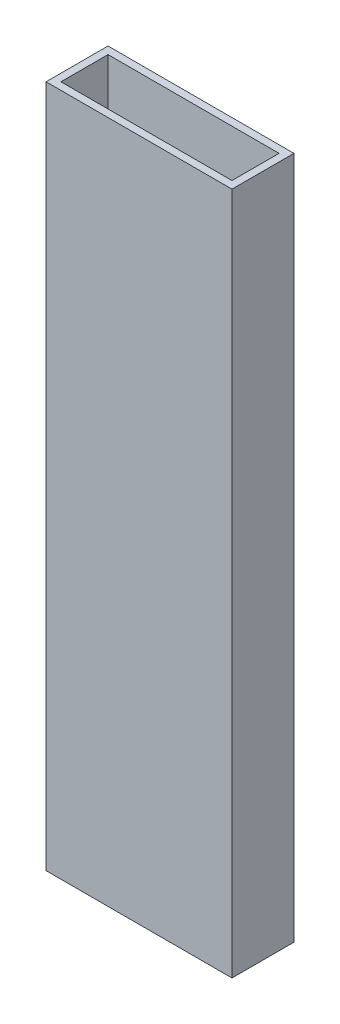
ISO-10303-21;
HEADER;
FILE_DESCRIPTION(('STEP AP214'),'2;1');
FILE_NAME('part.step','',(''),(''),'','','');
FILE_SCHEMA(('AUTOMOTIVE_DESIGN { 1 0 10303 214 1 1 1 1 }'));
ENDSEC;
DATA;
#1=APPLICATION_CONTEXT('core data for automotive mechanical design processes');
#2=APPLICATION_PROTOCOL_DEFINITION('international standard','automotive_design',2000,#1);
#3=PRODUCT_CONTEXT('',#1,'mechanical');
#4=PRODUCT('Part','Part','',(#3));
#5=PRODUCT_RELATED_PRODUCT_CATEGORY('part','',(#4));
#6=PRODUCT_DEFINITION_FORMATION('','',#4);
#7=PRODUCT_DEFINITION_CONTEXT('part definition',#1,'design');
#8=PRODUCT_DEFINITION('design','',#6,#7);
#9=PRODUCT_DEFINITION_SHAPE('','',#8);
#10=(LENGTH_UNIT() NAMED_UNIT(*) SI_UNIT(.MILLI.,.METRE.));
#11=(NAMED_UNIT(*) PLANE_ANGLE_UNIT() SI_UNIT($,.RADIAN.));
#12=(NAMED_UNIT(*) SI_UNIT($,.STERADIAN.) SOLID_ANGLE_UNIT());
#13=UNCERTAINTY_MEASURE_WITH_UNIT(LENGTH_MEASURE(1.E-05),#10,'distance_accuracy_value','');
#14=(GEOMETRIC_REPRESENTATION_CONTEXT(3) GLOBAL_UNCERTAINTY_ASSIGNED_CONTEXT((#13)) GLOBAL_UNIT_ASSIGNED_CONTEXT((#10,
#11,#12)) REPRESENTATION_CONTEXT('',''));
#15=CARTESIAN_POINT('',(0.,0.,0.));
#16=DIRECTION('',(0.,0.,1.));
#17=DIRECTION('',(1.,0.,0.));
#18=AXIS2_PLACEMENT_3D('',#15,#16,#17);
#19=CARTESIAN_POINT('',(-38.1,305.4,-12.7));
#20=DIRECTION('',(1.,0.,0.));
#21=DIRECTION('',(0.,0.,-1.));
#22=AXIS2_PLACEMENT_3D('',#19,#20,#21);
#23=PLANE('',#22);
#24=DIRECTION('',(0.,0.,1.));
#25=VECTOR('',#24,1.);
#26=CARTESIAN_POINT('',(-38.1,12.7,-38.1));
#27=LINE('',#26,#25);
#28=CARTESIAN_POINT('',(-38.1,12.7,-12.7));
#29=VERTEX_POINT('',#28);
#30=CARTESIAN_POINT('',(-38.1,12.7,12.7));
#31=VERTEX_POINT('',#30);
#32=EDGE_CURVE('E50',#29,#31,#27,.T.);
#33=ORIENTED_EDGE('',*,*,#32,.T.);
#34=DIRECTION('',(0.,-1.,0.));
#35=VECTOR('',#34,1.);
#36=CARTESIAN_POINT('',(-38.1,305.4,12.7));
#37=LINE('',#36,#35);
#38=CARTESIAN_POINT('',(-38.1,292.7,12.7));
#39=VERTEX_POINT('',#38);
#40=EDGE_CURVE('E112',#39,#31,#37,.T.);
#41=ORIENTED_EDGE('',*,*,#40,.F.);
#42=DIRECTION('',(0.,0.,1.));
#43=VECTOR('',#42,1.);
#44=CARTESIAN_POINT('',(-38.1,292.7,-38.1));
#45=LINE('',#44,#43);
#46=CARTESIAN_POINT('',(-38.1,292.7,-12.7));
#47=VERTEX_POINT('',#46);
#48=EDGE_CURVE('E105',#47,#39,#45,.T.);
#49=ORIENTED_EDGE('',*,*,#48,.F.);
#50=DIRECTION('',(0.,-1.,0.));
#51=VECTOR('',#50,1.);
#52=CARTESIAN_POINT('',(-38.1,305.4,-12.7));
#53=LINE('',#52,#51);
#54=EDGE_CURVE('E114',#47,#29,#53,.T.);
#55=ORIENTED_EDGE('',*,*,#54,.T.);
#56=EDGE_LOOP('',(#33,#41,#49,#55));
#57=FACE_BOUND('',#56,.T.);
#58=ADVANCED_FACE('F36',(#57),#23,.F.);
#59=CARTESIAN_POINT('',(-38.1,305.4,12.7));
#60=DIRECTION('',(0.,0.,-1.));
#61=DIRECTION('',(-1.,0.,0.));
#62=AXIS2_PLACEMENT_3D('',#59,#60,#61);
#63=PLANE('',#62);
#64=DIRECTION('',(-1.,0.,0.));
#65=VECTOR('',#64,1.);
#66=CARTESIAN_POINT('',(-38.1,12.7,12.7));
#67=LINE('',#66,#65);
#68=CARTESIAN_POINT('',(38.1,12.7,12.7));
#69=VERTEX_POINT('',#68);
#70=EDGE_CURVE('E97',#69,#31,#67,.T.);
#71=ORIENTED_EDGE('',*,*,#70,.F.);
#72=DIRECTION('',(0.,-1.,0.));
#73=VECTOR('',#72,1.);
#74=CARTESIAN_POINT('',(38.1,305.4,12.7));
#75=LINE('',#74,#73);
#76=CARTESIAN_POINT('',(38.1,292.7,12.7));
#77=VERTEX_POINT('',#76);
#78=EDGE_CURVE('E119',#77,#69,#75,.T.);
#79=ORIENTED_EDGE('',*,*,#78,.F.);
#80=DIRECTION('',(1.,0.,0.));
#81=VECTOR('',#80,1.);
#82=CARTESIAN_POINT('',(-38.1,292.7,12.7));
#83=LINE('',#82,#81);
#84=EDGE_CURVE('E118',#39,#77,#83,.T.);
#85=ORIENTED_EDGE('',*,*,#84,.F.);
#86=ORIENTED_EDGE('',*,*,#40,.T.);
#87=EDGE_LOOP('',(#71,#79,#85,#86));
#88=FACE_BOUND('',#87,.T.);
#89=ADVANCED_FACE('F117',(#88),#63,.F.);
#90=CARTESIAN_POINT('',(38.1,305.4,-12.7));
#91=DIRECTION('',(-1.,0.,0.));
#92=DIRECTION('',(0.,0.,1.));
#93=AXIS2_PLACEMENT_3D('',#90,#91,#92);
#94=PLANE('',#93);
#95=DIRECTION('',(0.,0.,1.));
#96=VECTOR('',#95,1.);
#97=CARTESIAN_POINT('',(38.1,12.7,-38.1));
#98=LINE('',#97,#96);
#99=CARTESIAN_POINT('',(38.1,12.7,-12.7));
#100=VERTEX_POINT('',#99);
#101=EDGE_CURVE('E100',#100,#69,#98,.T.);
#102=ORIENTED_EDGE('',*,*,#101,.F.);
#103=DIRECTION('',(0.,-1.,0.));
#104=VECTOR('',#103,1.);
#105=CARTESIAN_POINT('',(38.1,305.4,-12.7));
#106=LINE('',#105,#104);
#107=CARTESIAN_POINT('',(38.1,292.7,-12.7));
#108=VERTEX_POINT('',#107);
#109=EDGE_CURVE('E122',#108,#100,#106,.T.);
#110=ORIENTED_EDGE('',*,*,#109,.F.);
#111=DIRECTION('',(0.,0.,1.));
#112=VECTOR('',#111,1.);
#113=CARTESIAN_POINT('',(38.1,292.7,-38.1));
#114=LINE('',#113,#112);
#115=EDGE_CURVE('E152',#108,#77,#114,.T.);
#116=ORIENTED_EDGE('',*,*,#115,.T.);
#117=ORIENTED_EDGE('',*,*,#78,.T.);
#118=EDGE_LOOP('',(#102,#110,#116,#117));
#119=FACE_BOUND('',#118,.T.);
#120=ADVANCED_FACE('F189',(#119),#94,.F.);
#121=CARTESIAN_POINT('',(-38.1,305.4,-12.7));
#122=DIRECTION('',(0.,0.,1.));
#123=DIRECTION('',(1.,0.,0.));
#124=AXIS2_PLACEMENT_3D('',#121,#122,#123);
#125=PLANE('',#124);
#126=DIRECTION('',(1.,0.,0.));
#127=VECTOR('',#126,1.);
#128=CARTESIAN_POINT('',(-38.1,12.7,-12.7));
#129=LINE('',#128,#127);
#130=EDGE_CURVE('E106',#29,#100,#129,.T.);
#131=ORIENTED_EDGE('',*,*,#130,.F.);
#132=ORIENTED_EDGE('',*,*,#54,.F.);
#133=DIRECTION('',(-1.,0.,0.));
#134=VECTOR('',#133,1.);
#135=CARTESIAN_POINT('',(-38.1,292.7,-12.7));
#136=LINE('',#135,#134);
#137=EDGE_CURVE('E141',#108,#47,#136,.T.);
#138=ORIENTED_EDGE('',*,*,#137,.F.);
#139=ORIENTED_EDGE('',*,*,#109,.T.);
#140=EDGE_LOOP('',(#131,#132,#138,#139));
#141=FACE_BOUND('',#140,.T.);
#142=ADVANCED_FACE('F193',(#141),#125,.F.);
#143=CARTESIAN_POINT('',(-35.052,305.4,-9.65199999999999));
#144=DIRECTION('',(1.,0.,0.));
#145=DIRECTION('',(0.,0.,-1.));
#146=AXIS2_PLACEMENT_3D('',#143,#144,#145);
#147=PLANE('',#146);
#148=DIRECTION('',(0.,-1.,0.));
#149=VECTOR('',#148,1.);
#150=CARTESIAN_POINT('',(-35.052,305.4,9.652));
#151=LINE('',#150,#149);
#152=CARTESIAN_POINT('',(-35.052,292.7,9.652));
#153=VERTEX_POINT('',#152);
#154=CARTESIAN_POINT('',(-35.052,12.7,9.652));
#155=VERTEX_POINT('',#154);
#156=EDGE_CURVE('E128',#153,#155,#151,.T.);
#157=ORIENTED_EDGE('',*,*,#156,.T.);
#158=DIRECTION('',(0.,0.,-1.));
#159=VECTOR('',#158,1.);
#160=CARTESIAN_POINT('',(-35.052,12.7,-9.65199999999997));
#161=LINE('',#160,#159);
#162=CARTESIAN_POINT('',(-35.052,12.7,-9.65199999999999));
#163=VERTEX_POINT('',#162);
#164=EDGE_CURVE('E157',#155,#163,#161,.T.);
#165=ORIENTED_EDGE('',*,*,#164,.T.);
#166=DIRECTION('',(0.,-1.,0.));
#167=VECTOR('',#166,1.);
#168=CARTESIAN_POINT('',(-35.052,305.4,-9.65199999999999));
#169=LINE('',#168,#167);
#170=CARTESIAN_POINT('',(-35.052,292.7,-9.65199999999999));
#171=VERTEX_POINT('',#170);
#172=EDGE_CURVE('E137',#171,#163,#169,.T.);
#173=ORIENTED_EDGE('',*,*,#172,.F.);
#174=DIRECTION('',(0.,0.,1.));
#175=VECTOR('',#174,1.);
#176=CARTESIAN_POINT('',(-35.052,292.7,-9.65199999999999));
#177=LINE('',#176,#175);
#178=EDGE_CURVE('E143',#171,#153,#177,.T.);
#179=ORIENTED_EDGE('',*,*,#178,.T.);
#180=EDGE_LOOP('',(#157,#165,#173,#179));
#181=FACE_BOUND('',#180,.T.);
#182=ADVANCED_FACE('F176',(#181),#147,.T.);
#183=CARTESIAN_POINT('',(-35.052,305.4,9.652));
#184=DIRECTION('',(0.,0.,-1.));
#185=DIRECTION('',(-1.,0.,0.));
#186=AXIS2_PLACEMENT_3D('',#183,#184,#185);
#187=PLANE('',#186);
#188=DIRECTION('',(0.,-1.,0.));
#189=VECTOR('',#188,1.);
#190=CARTESIAN_POINT('',(35.052,305.4,9.65199999999999));
#191=LINE('',#190,#189);
#192=CARTESIAN_POINT('',(35.052,292.7,9.65199999999999));
#193=VERTEX_POINT('',#192);
#194=CARTESIAN_POINT('',(35.052,12.7,9.65199999999999));
#195=VERTEX_POINT('',#194);
#196=EDGE_CURVE('E131',#193,#195,#191,.T.);
#197=ORIENTED_EDGE('',*,*,#196,.T.);
#198=DIRECTION('',(-1.,0.,0.));
#199=VECTOR('',#198,1.);
#200=CARTESIAN_POINT('',(-35.052,12.7,9.652));
#201=LINE('',#200,#199);
#202=EDGE_CURVE('E160',#195,#155,#201,.T.);
#203=ORIENTED_EDGE('',*,*,#202,.T.);
#204=ORIENTED_EDGE('',*,*,#156,.F.);
#205=DIRECTION('',(1.,0.,0.));
#206=VECTOR('',#205,1.);
#207=CARTESIAN_POINT('',(-35.052,292.7,9.652));
#208=LINE('',#207,#206);
#209=EDGE_CURVE('E146',#153,#193,#208,.T.);
#210=ORIENTED_EDGE('',*,*,#209,.T.);
#211=EDGE_LOOP('',(#197,#203,#204,#210));
#212=FACE_BOUND('',#211,.T.);
#213=ADVANCED_FACE('F169',(#212),#187,.T.);
#214=CARTESIAN_POINT('',(35.052,305.4,-9.652));
#215=DIRECTION('',(-1.,0.,0.));
#216=DIRECTION('',(0.,0.,1.));
#217=AXIS2_PLACEMENT_3D('',#214,#215,#216);
#218=PLANE('',#217);
#219=DIRECTION('',(0.,-1.,0.));
#220=VECTOR('',#219,1.);
#221=CARTESIAN_POINT('',(35.052,305.4,-9.652));
#222=LINE('',#221,#220);
#223=CARTESIAN_POINT('',(35.052,292.7,-9.652));
#224=VERTEX_POINT('',#223);
#225=CARTESIAN_POINT('',(35.052,12.7,-9.652));
#226=VERTEX_POINT('',#225);
#227=EDGE_CURVE('E134',#224,#226,#222,.T.);
#228=ORIENTED_EDGE('',*,*,#227,.T.);
#229=DIRECTION('',(0.,0.,1.));
#230=VECTOR('',#229,1.);
#231=CARTESIAN_POINT('',(35.052,12.7,-9.65199999999998));
#232=LINE('',#231,#230);
#233=EDGE_CURVE('E58',#226,#195,#232,.T.);
#234=ORIENTED_EDGE('',*,*,#233,.T.);
#235=ORIENTED_EDGE('',*,*,#196,.F.);
#236=DIRECTION('',(0.,0.,-1.));
#237=VECTOR('',#236,1.);
#238=CARTESIAN_POINT('',(35.052,292.7,-9.652));
#239=LINE('',#238,#237);
#240=EDGE_CURVE('E149',#193,#224,#239,.T.);
#241=ORIENTED_EDGE('',*,*,#240,.T.);
#242=EDGE_LOOP('',(#228,#234,#235,#241));
#243=FACE_BOUND('',#242,.T.);
#244=ADVANCED_FACE('F166',(#243),#218,.T.);
#245=CARTESIAN_POINT('',(-35.052,305.4,-9.65199999999999));
#246=DIRECTION('',(0.,0.,1.));
#247=DIRECTION('',(1.,0.,0.));
#248=AXIS2_PLACEMENT_3D('',#245,#246,#247);
#249=PLANE('',#248);
#250=ORIENTED_EDGE('',*,*,#172,.T.);
#251=DIRECTION('',(1.,0.,0.));
#252=VECTOR('',#251,1.);
#253=CARTESIAN_POINT('',(-35.052,12.7,-9.65199999999999));
#254=LINE('',#253,#252);
#255=EDGE_CURVE('E11',#163,#226,#254,.T.);
#256=ORIENTED_EDGE('',*,*,#255,.T.);
#257=ORIENTED_EDGE('',*,*,#227,.F.);
#258=DIRECTION('',(-1.,0.,0.));
#259=VECTOR('',#258,1.);
#260=CARTESIAN_POINT('',(-35.052,292.7,-9.65199999999999));
#261=LINE('',#260,#259);
#262=EDGE_CURVE('E43',#224,#171,#261,.T.);
#263=ORIENTED_EDGE('',*,*,#262,.T.);
#264=EDGE_LOOP('',(#250,#256,#257,#263));
#265=FACE_BOUND('',#264,.T.);
#266=ADVANCED_FACE('F178',(#265),#249,.T.);
#267=CARTESIAN_POINT('',(-38.1,292.7,-38.1));
#268=DIRECTION('',(0.,1.,0.));
#269=DIRECTION('',(0.,0.,1.));
#270=AXIS2_PLACEMENT_3D('',#267,#268,#269);
#271=PLANE('',#270);
#272=ORIENTED_EDGE('',*,*,#262,.F.);
#273=ORIENTED_EDGE('',*,*,#240,.F.);
#274=ORIENTED_EDGE('',*,*,#209,.F.);
#275=ORIENTED_EDGE('',*,*,#178,.F.);
#276=EDGE_LOOP('',(#272,#273,#274,#275));
#277=FACE_BOUND('',#276,.T.);
#278=ORIENTED_EDGE('',*,*,#84,.T.);
#279=ORIENTED_EDGE('',*,*,#115,.F.);
#280=ORIENTED_EDGE('',*,*,#137,.T.);
#281=ORIENTED_EDGE('',*,*,#48,.T.);
#282=EDGE_LOOP('',(#278,#279,#280,#281));
#283=FACE_BOUND('',#282,.T.);
#284=ADVANCED_FACE('F172',(#277,#283),#271,.T.);
#285=CARTESIAN_POINT('',(38.1,12.7,-38.1));
#286=DIRECTION('',(0.,-1.,0.));
#287=DIRECTION('',(0.,0.,-1.));
#288=AXIS2_PLACEMENT_3D('',#285,#286,#287);
#289=PLANE('',#288);
#290=ORIENTED_EDGE('',*,*,#202,.F.);
#291=ORIENTED_EDGE('',*,*,#233,.F.);
#292=ORIENTED_EDGE('',*,*,#255,.F.);
#293=ORIENTED_EDGE('',*,*,#164,.F.);
#294=EDGE_LOOP('',(#290,#291,#292,#293));
#295=FACE_BOUND('',#294,.T.);
#296=ORIENTED_EDGE('',*,*,#70,.T.);
#297=ORIENTED_EDGE('',*,*,#32,.F.);
#298=ORIENTED_EDGE('',*,*,#130,.T.);
#299=ORIENTED_EDGE('',*,*,#101,.T.);
#300=EDGE_LOOP('',(#296,#297,#298,#299));
#301=FACE_BOUND('',#300,.T.);
#302=ADVANCED_FACE('F98',(#295,#301),#289,.T.);
#303=CLOSED_SHELL('',(#58,#89,#120,#142,#182,#213,#244,#266,#284,#302));
#304=MANIFOLD_SOLID_BREP('B2',#303);
#305=ADVANCED_BREP_SHAPE_REPRESENTATION('',(#18,#304),#14);
#306=SHAPE_DEFINITION_REPRESENTATION(#9,#305);
ENDSEC;
END-ISO-10303-21;
